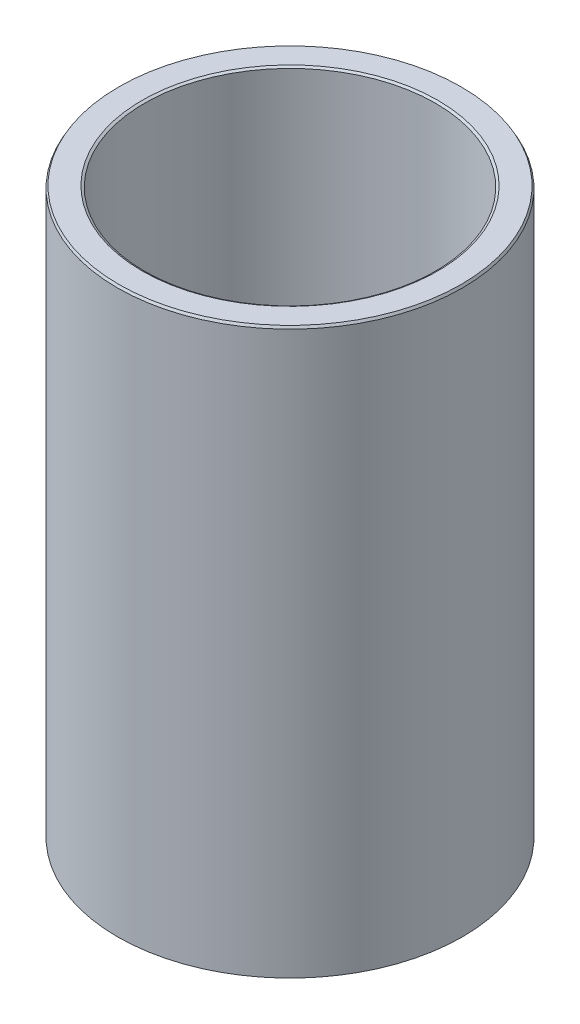
ISO-10303-21;
HEADER;
FILE_DESCRIPTION(('STEP AP214'),'2;1');
FILE_NAME('part.step','',(''),(''),'','','');
FILE_SCHEMA(('AUTOMOTIVE_DESIGN { 1 0 10303 214 1 1 1 1 }'));
ENDSEC;
DATA;
#1=APPLICATION_CONTEXT('core data for automotive mechanical design processes');
#2=APPLICATION_PROTOCOL_DEFINITION('international standard','automotive_design',2000,#1);
#3=PRODUCT_CONTEXT('',#1,'mechanical');
#4=PRODUCT('Part','Part','',(#3));
#5=PRODUCT_RELATED_PRODUCT_CATEGORY('part','',(#4));
#6=PRODUCT_DEFINITION_FORMATION('','',#4);
#7=PRODUCT_DEFINITION_CONTEXT('part definition',#1,'design');
#8=PRODUCT_DEFINITION('design','',#6,#7);
#9=PRODUCT_DEFINITION_SHAPE('','',#8);
#10=(LENGTH_UNIT() NAMED_UNIT(*) SI_UNIT(.MILLI.,.METRE.));
#11=(NAMED_UNIT(*) PLANE_ANGLE_UNIT() SI_UNIT($,.RADIAN.));
#12=(NAMED_UNIT(*) SI_UNIT($,.STERADIAN.) SOLID_ANGLE_UNIT());
#13=UNCERTAINTY_MEASURE_WITH_UNIT(LENGTH_MEASURE(1.E-05),#10,'distance_accuracy_value','');
#14=(GEOMETRIC_REPRESENTATION_CONTEXT(3) GLOBAL_UNCERTAINTY_ASSIGNED_CONTEXT((#13)) GLOBAL_UNIT_ASSIGNED_CONTEXT((#10,
#11,#12)) REPRESENTATION_CONTEXT('',''));
#15=CARTESIAN_POINT('',(0.,0.,0.));
#16=DIRECTION('',(0.,0.,1.));
#17=DIRECTION('',(1.,0.,0.));
#18=AXIS2_PLACEMENT_3D('',#15,#16,#17);
#19=CARTESIAN_POINT('',(0.,172.152970546802,0.));
#20=DIRECTION('',(0.,-1.,0.));
#21=DIRECTION('',(0.,0.,-1.));
#22=AXIS2_PLACEMENT_3D('',#19,#20,#21);
#23=CYLINDRICAL_SURFACE('',#22,52.5);
#24=CARTESIAN_POINT('',(0.,0.413746510304264,0.));
#25=DIRECTION('',(0.,1.,0.));
#26=DIRECTION('',(0.,0.,1.));
#27=AXIS2_PLACEMENT_3D('',#24,#25,#26);
#28=CIRCLE('',#27,52.5);
#29=CARTESIAN_POINT('',(0.,0.413746510304264,-52.5));
#30=VERTEX_POINT('',#29);
#31=EDGE_CURVE('E10',#30,#30,#28,.T.);
#32=CARTESIAN_POINT('',(0.,171.436340569501,0.));
#33=DIRECTION('',(0.,1.,0.));
#34=DIRECTION('',(0.,0.,1.));
#35=AXIS2_PLACEMENT_3D('',#32,#33,#34);
#36=CIRCLE('',#35,52.5);
#37=CARTESIAN_POINT('',(0.,171.436340569501,-52.5));
#38=VERTEX_POINT('',#37);
#39=EDGE_CURVE('E50',#38,#38,#36,.F.);
#40=CARTESIAN_POINT('',(0.,0.413746510304264,-52.5));
#41=CARTESIAN_POINT('',(0.,2.19523186508756,-52.5));
#42=CARTESIAN_POINT('',(0.,3.97671721987085,-52.5));
#43=CARTESIAN_POINT('',(0.,7.53968792943744,-52.5));
#44=CARTESIAN_POINT('',(0.,9.32117328422074,-52.5));
#45=CARTESIAN_POINT('',(0.,12.8841439937873,-52.5));
#46=CARTESIAN_POINT('',(0.,14.6656293485706,-52.5));
#47=CARTESIAN_POINT('',(0.,18.2286000581372,-52.5));
#48=CARTESIAN_POINT('',(0.,20.0100854129205,-52.5));
#49=CARTESIAN_POINT('',(0.,23.5730561224871,-52.5));
#50=CARTESIAN_POINT('',(0.,25.3545414772704,-52.5));
#51=CARTESIAN_POINT('',(0.,28.917512186837,-52.5));
#52=CARTESIAN_POINT('',(0.,30.6989975416203,-52.5));
#53=CARTESIAN_POINT('',(0.,34.2619682511869,-52.5));
#54=CARTESIAN_POINT('',(0.,36.0434536059702,-52.5));
#55=CARTESIAN_POINT('',(0.,39.6064243155368,-52.5));
#56=CARTESIAN_POINT('',(0.,41.38790967032,-52.5));
#57=CARTESIAN_POINT('',(0.,44.9508803798866,-52.5));
#58=CARTESIAN_POINT('',(0.,46.7323657346699,-52.5));
#59=CARTESIAN_POINT('',(0.,50.2953364442365,-52.5));
#60=CARTESIAN_POINT('',(0.,52.0768217990198,-52.5));
#61=CARTESIAN_POINT('',(0.,55.6397925085864,-52.5));
#62=CARTESIAN_POINT('',(0.,57.4212778633697,-52.5));
#63=CARTESIAN_POINT('',(0.,60.9842485729363,-52.5));
#64=CARTESIAN_POINT('',(0.,62.7657339277196,-52.5));
#65=CARTESIAN_POINT('',(0.,66.3287046372862,-52.5));
#66=CARTESIAN_POINT('',(0.,68.1101899920695,-52.5));
#67=CARTESIAN_POINT('',(0.,71.6731607016361,-52.5));
#68=CARTESIAN_POINT('',(0.,73.4546460564193,-52.5));
#69=CARTESIAN_POINT('',(0.,77.0176167659859,-52.5));
#70=CARTESIAN_POINT('',(0.,78.7991021207692,-52.5));
#71=CARTESIAN_POINT('',(0.,82.3620728303358,-52.5));
#72=CARTESIAN_POINT('',(0.,84.1435581851191,-52.5));
#73=CARTESIAN_POINT('',(0.,87.7065288946857,-52.5));
#74=CARTESIAN_POINT('',(0.,89.488014249469,-52.5));
#75=CARTESIAN_POINT('',(0.,93.0509849590356,-52.5));
#76=CARTESIAN_POINT('',(0.,94.8324703138189,-52.5));
#77=CARTESIAN_POINT('',(0.,98.3954410233855,-52.5));
#78=CARTESIAN_POINT('',(0.,100.176926378169,-52.5));
#79=CARTESIAN_POINT('',(0.,103.739897087735,-52.5));
#80=CARTESIAN_POINT('',(0.,105.521382442519,-52.5));
#81=CARTESIAN_POINT('',(0.,109.084353152085,-52.5));
#82=CARTESIAN_POINT('',(0.,110.865838506869,-52.5));
#83=CARTESIAN_POINT('',(0.,114.428809216435,-52.5));
#84=CARTESIAN_POINT('',(0.,116.210294571218,-52.5));
#85=CARTESIAN_POINT('',(0.,119.773265280785,-52.5));
#86=CARTESIAN_POINT('',(0.,121.554750635568,-52.5));
#87=CARTESIAN_POINT('',(0.,125.117721345135,-52.5));
#88=CARTESIAN_POINT('',(0.,126.899206699918,-52.5));
#89=CARTESIAN_POINT('',(0.,130.462177409485,-52.5));
#90=CARTESIAN_POINT('',(0.,132.243662764268,-52.5));
#91=CARTESIAN_POINT('',(0.,135.806633473835,-52.5));
#92=CARTESIAN_POINT('',(0.,137.588118828618,-52.5));
#93=CARTESIAN_POINT('',(0.,141.151089538185,-52.5));
#94=CARTESIAN_POINT('',(0.,142.932574892968,-52.5));
#95=CARTESIAN_POINT('',(0.,146.495545602534,-52.5));
#96=CARTESIAN_POINT('',(0.,148.277030957318,-52.5));
#97=CARTESIAN_POINT('',(0.,151.840001666884,-52.5));
#98=CARTESIAN_POINT('',(0.,153.621487021668,-52.5));
#99=CARTESIAN_POINT('',(0.,157.184457731234,-52.5));
#100=CARTESIAN_POINT('',(0.,158.965943086018,-52.5));
#101=CARTESIAN_POINT('',(0.,162.528913795584,-52.5));
#102=CARTESIAN_POINT('',(0.,164.310399150367,-52.5));
#103=CARTESIAN_POINT('',(0.,167.873369859934,-52.5));
#104=CARTESIAN_POINT('',(0.,169.654855214717,-52.5));
#105=CARTESIAN_POINT('',(0.,171.436340569501,-52.5));
#106=B_SPLINE_CURVE_WITH_KNOTS('',3,(#40,#41,#42,#43,#44,#45,#46,#47,#48,#49,#50,#51,#52,#53,
#54,#55,#56,#57,#58,#59,#60,#61,#62,#63,#64,#65,#66,#67,#68,#69,#70,#71,#72,#73,#74,#75,#76,#77,
#78,#79,#80,#81,#82,#83,#84,#85,#86,#87,#88,#89,#90,#91,#92,#93,#94,#95,#96,#97,#98,#99,#100,
#101,#102,#103,#104,#105),.UNSPECIFIED.,.F.,.F.,(4,2,2,2,2,2,2,2,2,2,2,2,2,2,2,2,2,2,2,2,2,2,2,
2,2,2,2,2,2,2,2,2,4),(0.,5.34445606434988,10.6889121286998,16.0333681930497,21.3778242573995,
26.7222803217494,32.0667363860993,37.4111924504492,42.7556485147991,48.100104579149,
53.4445606434988,58.7890167078487,64.1334727721986,69.4779288365485,74.8223849008984,
80.1668409652483,85.5112970295982,90.855753093948,96.2002091582979,101.544665222648,
106.889121286998,112.233577351348,117.578033415697,122.922489480047,128.266945544397,
133.611401608747,138.955857673097,144.300313737447,149.644769801797,154.989225866147,
160.333681930497,165.678137994846,171.022594059196),.UNSPECIFIED.);
#107=EDGE_CURVE('BSEAM39',#30,#38,#106,.T.);
#108=ORIENTED_EDGE('',*,*,#31,.T.);
#109=ORIENTED_EDGE('',*,*,#39,.T.);
#110=ORIENTED_EDGE('',*,*,#107,.T.);
#111=ORIENTED_EDGE('',*,*,#107,.F.);
#112=EDGE_LOOP('',(#108,#110,#109,#111));
#113=FACE_BOUND('',#112,.T.);
#114=ADVANCED_FACE('F39',(#113),#23,.T.);
#115=CARTESIAN_POINT('',(0.,172.152970546802,0.));
#116=DIRECTION('',(0.,1.,0.));
#117=DIRECTION('',(0.,0.,1.));
#118=AXIS2_PLACEMENT_3D('',#115,#116,#117);
#119=PLANE('',#118);
#120=CARTESIAN_POINT('',(0.,172.152970546802,0.));
#121=DIRECTION('',(0.,1.,0.));
#122=DIRECTION('',(0.,0.,1.));
#123=AXIS2_PLACEMENT_3D('',#120,#121,#122);
#124=CIRCLE('',#123,44.9941447066528);
#125=CARTESIAN_POINT('',(0.,172.152970546802,44.9941447066528));
#126=VERTEX_POINT('',#125);
#127=EDGE_CURVE('E58',#126,#126,#124,.F.);
#128=ORIENTED_EDGE('',*,*,#127,.T.);
#129=EDGE_LOOP('',(#128));
#130=FACE_BOUND('',#129,.T.);
#131=CARTESIAN_POINT('',(0.,172.152970546802,0.));
#132=DIRECTION('',(0.,1.,0.));
#133=DIRECTION('',(0.,0.,1.));
#134=AXIS2_PLACEMENT_3D('',#131,#132,#133);
#135=CIRCLE('',#134,52.0862534896959);
#136=CARTESIAN_POINT('',(0.,172.152970546802,52.0862534896959));
#137=VERTEX_POINT('',#136);
#138=EDGE_CURVE('E61',#137,#137,#135,.T.);
#139=ORIENTED_EDGE('',*,*,#138,.T.);
#140=EDGE_LOOP('',(#139));
#141=FACE_BOUND('',#140,.T.);
#142=ADVANCED_FACE('F88',(#130,#141),#119,.T.);
#143=CARTESIAN_POINT('',(0.,0.,0.));
#144=DIRECTION('',(0.,1.,0.));
#145=DIRECTION('',(0.,0.,1.));
#146=AXIS2_PLACEMENT_3D('',#143,#144,#145);
#147=PLANE('',#146);
#148=CARTESIAN_POINT('',(0.,0.,0.));
#149=DIRECTION('',(0.,1.,0.));
#150=DIRECTION('',(0.,0.,1.));
#151=AXIS2_PLACEMENT_3D('',#148,#149,#150);
#152=CIRCLE('',#151,44.6912612396558);
#153=CARTESIAN_POINT('',(0.,0.,44.6912612396558));
#154=VERTEX_POINT('',#153);
#155=EDGE_CURVE('E51',#154,#154,#152,.T.);
#156=ORIENTED_EDGE('',*,*,#155,.T.);
#157=EDGE_LOOP('',(#156));
#158=FACE_BOUND('',#157,.T.);
#159=CARTESIAN_POINT('',(0.,0.,0.));
#160=DIRECTION('',(0.,1.,0.));
#161=DIRECTION('',(0.,0.,1.));
#162=AXIS2_PLACEMENT_3D('',#159,#160,#161);
#163=CIRCLE('',#162,51.7833700226987);
#164=CARTESIAN_POINT('',(0.,0.,51.7833700226987));
#165=VERTEX_POINT('',#164);
#166=EDGE_CURVE('E54',#165,#165,#163,.F.);
#167=ORIENTED_EDGE('',*,*,#166,.T.);
#168=EDGE_LOOP('',(#167));
#169=FACE_BOUND('',#168,.T.);
#170=ADVANCED_FACE('F83',(#158,#169),#147,.F.);
#171=CARTESIAN_POINT('',(0.,172.152970546802,0.));
#172=DIRECTION('',(0.,-1.,0.));
#173=DIRECTION('',(0.,0.,-1.));
#174=AXIS2_PLACEMENT_3D('',#171,#172,#173);
#175=CYLINDRICAL_SURFACE('',#174,44.2775147293516);
#176=CARTESIAN_POINT('',(0.,171.739224036497,0.));
#177=DIRECTION('',(0.,1.,0.));
#178=DIRECTION('',(0.,0.,1.));
#179=AXIS2_PLACEMENT_3D('',#176,#177,#178);
#180=CIRCLE('',#179,44.2775147293516);
#181=CARTESIAN_POINT('',(0.,171.739224036497,-44.2775147293516));
#182=VERTEX_POINT('',#181);
#183=EDGE_CURVE('E67',#182,#182,#180,.T.);
#184=CARTESIAN_POINT('',(0.,0.716629977301209,0.));
#185=DIRECTION('',(0.,1.,0.));
#186=DIRECTION('',(0.,0.,1.));
#187=AXIS2_PLACEMENT_3D('',#184,#185,#186);
#188=CIRCLE('',#187,44.2775147293516);
#189=CARTESIAN_POINT('',(0.,0.716629977301181,-44.2775147293516));
#190=VERTEX_POINT('',#189);
#191=EDGE_CURVE('E69',#190,#190,#188,.F.);
#192=CARTESIAN_POINT('',(0.,171.739224036497,-44.2775147293516));
#193=CARTESIAN_POINT('',(0.,169.957738681714,-44.2775147293516));
#194=CARTESIAN_POINT('',(0.,168.176253326931,-44.2775147293516));
#195=CARTESIAN_POINT('',(0.,164.613282617364,-44.2775147293516));
#196=CARTESIAN_POINT('',(0.,162.831797262581,-44.2775147293516));
#197=CARTESIAN_POINT('',(0.,159.268826553014,-44.2775147293516));
#198=CARTESIAN_POINT('',(0.,157.487341198231,-44.2775147293516));
#199=CARTESIAN_POINT('',(0.,153.924370488665,-44.2775147293516));
#200=CARTESIAN_POINT('',(0.,152.142885133881,-44.2775147293516));
#201=CARTESIAN_POINT('',(0.,148.579914424315,-44.2775147293516));
#202=CARTESIAN_POINT('',(0.,146.798429069531,-44.2775147293516));
#203=CARTESIAN_POINT('',(0.,143.235458359965,-44.2775147293516));
#204=CARTESIAN_POINT('',(0.,141.453973005181,-44.2775147293516));
#205=CARTESIAN_POINT('',(0.,137.891002295615,-44.2775147293516));
#206=CARTESIAN_POINT('',(0.,136.109516940832,-44.2775147293516));
#207=CARTESIAN_POINT('',(0.,132.546546231265,-44.2775147293516));
#208=CARTESIAN_POINT('',(0.,130.765060876482,-44.2775147293516));
#209=CARTESIAN_POINT('',(0.,127.202090166915,-44.2775147293516));
#210=CARTESIAN_POINT('',(0.,125.420604812132,-44.2775147293516));
#211=CARTESIAN_POINT('',(0.,121.857634102565,-44.2775147293516));
#212=CARTESIAN_POINT('',(0.,120.076148747782,-44.2775147293516));
#213=CARTESIAN_POINT('',(0.,116.513178038215,-44.2775147293516));
#214=CARTESIAN_POINT('',(0.,114.731692683432,-44.2775147293516));
#215=CARTESIAN_POINT('',(0.,111.168721973865,-44.2775147293516));
#216=CARTESIAN_POINT('',(0.,109.387236619082,-44.2775147293516));
#217=CARTESIAN_POINT('',(0.,105.824265909516,-44.2775147293516));
#218=CARTESIAN_POINT('',(0.,104.042780554732,-44.2775147293516));
#219=CARTESIAN_POINT('',(0.,100.479809845166,-44.2775147293516));
#220=CARTESIAN_POINT('',(0.,98.6983244903824,-44.2775147293516));
#221=CARTESIAN_POINT('',(0.,95.1353537808158,-44.2775147293516));
#222=CARTESIAN_POINT('',(0.,93.3538684260325,-44.2775147293516));
#223=CARTESIAN_POINT('',(0.,89.7908977164659,-44.2775147293516));
#224=CARTESIAN_POINT('',(0.,88.0094123616826,-44.2775147293516));
#225=CARTESIAN_POINT('',(0.,84.446441652116,-44.2775147293516));
#226=CARTESIAN_POINT('',(0.,82.6649562973328,-44.2775147293516));
#227=CARTESIAN_POINT('',(0.,79.1019855877662,-44.2775147293516));
#228=CARTESIAN_POINT('',(0.,77.3205002329829,-44.2775147293516));
#229=CARTESIAN_POINT('',(0.,73.7575295234163,-44.2775147293516));
#230=CARTESIAN_POINT('',(0.,71.976044168633,-44.2775147293516));
#231=CARTESIAN_POINT('',(0.,68.4130734590664,-44.2775147293516));
#232=CARTESIAN_POINT('',(0.,66.6315881042831,-44.2775147293516));
#233=CARTESIAN_POINT('',(0.,63.0686173947165,-44.2775147293516));
#234=CARTESIAN_POINT('',(0.,61.2871320399332,-44.2775147293516));
#235=CARTESIAN_POINT('',(0.,57.7241613303666,-44.2775147293516));
#236=CARTESIAN_POINT('',(0.,55.9426759755833,-44.2775147293516));
#237=CARTESIAN_POINT('',(0.,52.3797052660167,-44.2775147293516));
#238=CARTESIAN_POINT('',(0.,50.5982199112334,-44.2775147293516));
#239=CARTESIAN_POINT('',(0.,47.0352492016669,-44.2775147293516));
#240=CARTESIAN_POINT('',(0.,45.2537638468836,-44.2775147293516));
#241=CARTESIAN_POINT('',(0.,41.690793137317,-44.2775147293516));
#242=CARTESIAN_POINT('',(0.,39.9093077825337,-44.2775147293516));
#243=CARTESIAN_POINT('',(0.,36.3463370729671,-44.2775147293516));
#244=CARTESIAN_POINT('',(0.,34.5648517181838,-44.2775147293516));
#245=CARTESIAN_POINT('',(0.,31.0018810086172,-44.2775147293516));
#246=CARTESIAN_POINT('',(0.,29.2203956538339,-44.2775147293516));
#247=CARTESIAN_POINT('',(0.,25.6574249442673,-44.2775147293516));
#248=CARTESIAN_POINT('',(0.,23.875939589484,-44.2775147293516));
#249=CARTESIAN_POINT('',(0.,20.3129688799174,-44.2775147293516));
#250=CARTESIAN_POINT('',(0.,18.5314835251341,-44.2775147293516));
#251=CARTESIAN_POINT('',(0.,14.9685128155675,-44.2775147293516));
#252=CARTESIAN_POINT('',(0.,13.1870274607842,-44.2775147293516));
#253=CARTESIAN_POINT('',(0.,9.62405675121765,-44.2775147293516));
#254=CARTESIAN_POINT('',(0.,7.84257139643436,-44.2775147293516));
#255=CARTESIAN_POINT('',(0.,4.27960068686777,-44.2775147293516));
#256=CARTESIAN_POINT('',(0.,2.49811533208448,-44.2775147293516));
#257=CARTESIAN_POINT('',(0.,0.716629977301181,-44.2775147293516));
#258=B_SPLINE_CURVE_WITH_KNOTS('',3,(#192,#193,#194,#195,#196,#197,#198,#199,#200,#201,#202,
#203,#204,#205,#206,#207,#208,#209,#210,#211,#212,#213,#214,#215,#216,#217,#218,#219,#220,#221,
#222,#223,#224,#225,#226,#227,#228,#229,#230,#231,#232,#233,#234,#235,#236,#237,#238,#239,#240,
#241,#242,#243,#244,#245,#246,#247,#248,#249,#250,#251,#252,#253,#254,#255,#256,#257),
.UNSPECIFIED.,.F.,.F.,(4,2,2,2,2,2,2,2,2,2,2,2,2,2,2,2,2,2,2,2,2,2,2,2,2,2,2,2,2,2,2,2,4),(0.,
5.34445606434988,10.6889121286997,16.0333681930497,21.3778242573995,26.7222803217494,
32.0667363860993,37.4111924504492,42.755648514799,48.1001045791489,53.4445606434988,
58.7890167078487,64.1334727721986,69.4779288365485,74.8223849008984,80.1668409652482,
85.5112970295981,90.855753093948,96.2002091582979,101.544665222648,106.889121286998,
112.233577351348,117.578033415697,122.922489480047,128.266945544397,133.611401608747,
138.955857673097,144.300313737447,149.644769801797,154.989225866147,160.333681930497,
165.678137994846,171.022594059196),.UNSPECIFIED.);
#259=EDGE_CURVE('BSEAM71',#182,#190,#258,.T.);
#260=ORIENTED_EDGE('',*,*,#183,.T.);
#261=ORIENTED_EDGE('',*,*,#191,.T.);
#262=ORIENTED_EDGE('',*,*,#259,.T.);
#263=ORIENTED_EDGE('',*,*,#259,.F.);
#264=EDGE_LOOP('',(#260,#262,#261,#263));
#265=FACE_BOUND('',#264,.T.);
#266=ADVANCED_FACE('F71',(#265),#175,.F.);
#267=CARTESIAN_POINT('',(0.,171.739224036497,0.));
#268=DIRECTION('',(0.,1.,0.));
#269=DIRECTION('',(0.,0.,1.));
#270=AXIS2_PLACEMENT_3D('',#267,#268,#269);
#271=CONICAL_SURFACE('',#270,44.2775147293516,1.04719755119659);
#272=ORIENTED_EDGE('',*,*,#127,.F.);
#273=EDGE_LOOP('',(#272));
#274=FACE_BOUND('',#273,.T.);
#275=ORIENTED_EDGE('',*,*,#183,.F.);
#276=EDGE_LOOP('',(#275));
#277=FACE_BOUND('',#276,.T.);
#278=ADVANCED_FACE('F77',(#274,#277),#271,.F.);
#279=CARTESIAN_POINT('',(0.,0.,0.));
#280=DIRECTION('',(0.,-1.,0.));
#281=DIRECTION('',(0.,0.,-1.));
#282=AXIS2_PLACEMENT_3D('',#279,#280,#281);
#283=CONICAL_SURFACE('',#282,44.6912612396558,0.523598775598292);
#284=ORIENTED_EDGE('',*,*,#191,.F.);
#285=EDGE_LOOP('',(#284));
#286=FACE_BOUND('',#285,.T.);
#287=ORIENTED_EDGE('',*,*,#155,.F.);
#288=EDGE_LOOP('',(#287));
#289=FACE_BOUND('',#288,.T.);
#290=ADVANCED_FACE('F73',(#286,#289),#283,.F.);
#291=CARTESIAN_POINT('',(0.,0.413746510304264,0.));
#292=DIRECTION('',(0.,1.,0.));
#293=DIRECTION('',(0.,0.,1.));
#294=AXIS2_PLACEMENT_3D('',#291,#292,#293);
#295=CONICAL_SURFACE('',#294,52.5,1.04719755119662);
#296=ORIENTED_EDGE('',*,*,#166,.F.);
#297=EDGE_LOOP('',(#296));
#298=FACE_BOUND('',#297,.T.);
#299=ORIENTED_EDGE('',*,*,#31,.F.);
#300=EDGE_LOOP('',(#299));
#301=FACE_BOUND('',#300,.T.);
#302=ADVANCED_FACE('F76',(#298,#301),#295,.T.);
#303=CARTESIAN_POINT('',(0.,172.152970546802,0.));
#304=DIRECTION('',(0.,-1.,0.));
#305=DIRECTION('',(0.,0.,-1.));
#306=AXIS2_PLACEMENT_3D('',#303,#304,#305);
#307=CONICAL_SURFACE('',#306,52.0862534896959,0.523598775598277);
#308=ORIENTED_EDGE('',*,*,#39,.F.);
#309=EDGE_LOOP('',(#308));
#310=FACE_BOUND('',#309,.T.);
#311=ORIENTED_EDGE('',*,*,#138,.F.);
#312=EDGE_LOOP('',(#311));
#313=FACE_BOUND('',#312,.T.);
#314=ADVANCED_FACE('F45',(#310,#313),#307,.T.);
#315=CLOSED_SHELL('',(#114,#142,#170,#266,#278,#290,#302,#314));
#316=MANIFOLD_SOLID_BREP('B2',#315);
#317=ADVANCED_BREP_SHAPE_REPRESENTATION('',(#18,#316),#14);
#318=SHAPE_DEFINITION_REPRESENTATION(#9,#317);
ENDSEC;
END-ISO-10303-21;
